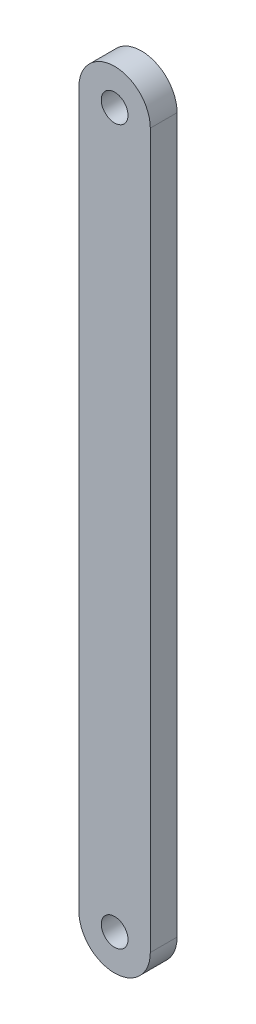
ISO-10303-21;
HEADER;
FILE_DESCRIPTION(('STEP AP214'),'2;1');
FILE_NAME('part.step','',(''),(''),'','','');
FILE_SCHEMA(('AUTOMOTIVE_DESIGN { 1 0 10303 214 1 1 1 1 }'));
ENDSEC;
DATA;
#1=APPLICATION_CONTEXT('core data for automotive mechanical design processes');
#2=APPLICATION_PROTOCOL_DEFINITION('international standard','automotive_design',2000,#1);
#3=PRODUCT_CONTEXT('',#1,'mechanical');
#4=PRODUCT('Part','Part','',(#3));
#5=PRODUCT_RELATED_PRODUCT_CATEGORY('part','',(#4));
#6=PRODUCT_DEFINITION_FORMATION('','',#4);
#7=PRODUCT_DEFINITION_CONTEXT('part definition',#1,'design');
#8=PRODUCT_DEFINITION('design','',#6,#7);
#9=PRODUCT_DEFINITION_SHAPE('','',#8);
#10=(LENGTH_UNIT() NAMED_UNIT(*) SI_UNIT(.MILLI.,.METRE.));
#11=(NAMED_UNIT(*) PLANE_ANGLE_UNIT() SI_UNIT($,.RADIAN.));
#12=(NAMED_UNIT(*) SI_UNIT($,.STERADIAN.) SOLID_ANGLE_UNIT());
#13=UNCERTAINTY_MEASURE_WITH_UNIT(LENGTH_MEASURE(1.E-05),#10,'distance_accuracy_value','');
#14=(GEOMETRIC_REPRESENTATION_CONTEXT(3) GLOBAL_UNCERTAINTY_ASSIGNED_CONTEXT((#13)) GLOBAL_UNIT_ASSIGNED_CONTEXT((#10,
#11,#12)) REPRESENTATION_CONTEXT('',''));
#15=CARTESIAN_POINT('',(0.,0.,0.));
#16=DIRECTION('',(0.,0.,1.));
#17=DIRECTION('',(1.,0.,0.));
#18=AXIS2_PLACEMENT_3D('',#15,#16,#17);
#19=CARTESIAN_POINT('',(2194.74014545616,1577.10008841039,3.));
#20=DIRECTION('',(0.,0.,1.));
#21=DIRECTION('',(1.,0.,0.));
#22=AXIS2_PLACEMENT_3D('',#19,#20,#21);
#23=PLANE('',#22);
#24=CARTESIAN_POINT('',(2194.74019545294,1577.10013840717,3.));
#25=DIRECTION('',(0.,0.,1.));
#26=DIRECTION('',(1.,0.,0.));
#27=AXIS2_PLACEMENT_3D('',#24,#25,#26);
#28=CIRCLE('',#27,1.50000000000011);
#29=CARTESIAN_POINT('',(2196.24019545294,1577.10013840717,3.));
#30=VERTEX_POINT('',#29);
#31=EDGE_CURVE('E100',#30,#30,#28,.T.);
#32=ORIENTED_EDGE('',*,*,#31,.F.);
#33=EDGE_LOOP('',(#32));
#34=FACE_BOUND('',#33,.T.);
#35=DIRECTION('',(0.,1.,0.));
#36=VECTOR('',#35,1.);
#37=CARTESIAN_POINT('',(2198.74014545616,1571.08621907019,3.));
#38=LINE('',#37,#36);
#39=CARTESIAN_POINT('',(2198.74014545517,1497.10008841174,3.));
#40=VERTEX_POINT('',#39);
#41=CARTESIAN_POINT('',(2198.74014545616,1577.10008841039,3.));
#42=VERTEX_POINT('',#41);
#43=EDGE_CURVE('E51',#40,#42,#38,.T.);
#44=ORIENTED_EDGE('',*,*,#43,.T.);
#45=CARTESIAN_POINT('',(2194.74014545616,1577.10008841039,3.));
#46=DIRECTION('',(0.,0.,1.));
#47=DIRECTION('',(1.,0.,0.));
#48=AXIS2_PLACEMENT_3D('',#45,#46,#47);
#49=CIRCLE('',#48,4.);
#50=CARTESIAN_POINT('',(2190.74014545616,1577.10008841039,3.));
#51=VERTEX_POINT('',#50);
#52=EDGE_CURVE('E81',#42,#51,#49,.T.);
#53=ORIENTED_EDGE('',*,*,#52,.T.);
#54=DIRECTION('',(2.22954618024291E-10,-1.,0.));
#55=VECTOR('',#54,1.);
#56=CARTESIAN_POINT('',(2190.74014545616,1577.10008841039,3.));
#57=LINE('',#56,#55);
#58=CARTESIAN_POINT('',(2190.74014545517,1497.10018841037,3.));
#59=VERTEX_POINT('',#58);
#60=EDGE_CURVE('E85',#51,#59,#57,.T.);
#61=ORIENTED_EDGE('',*,*,#60,.T.);
#62=CARTESIAN_POINT('',(2194.74014545455,1497.10008840878,3.));
#63=DIRECTION('',(0.,0.,1.));
#64=DIRECTION('',(1.,0.,0.));
#65=AXIS2_PLACEMENT_3D('',#62,#63,#64);
#66=CIRCLE('',#65,4.00000000062502);
#67=EDGE_CURVE('E93',#59,#40,#66,.T.);
#68=ORIENTED_EDGE('',*,*,#67,.T.);
#69=EDGE_LOOP('',(#44,#53,#61,#68));
#70=FACE_BOUND('',#69,.T.);
#71=CARTESIAN_POINT('',(2194.74014545455,1497.10008840878,3.));
#72=DIRECTION('',(0.,0.,1.));
#73=DIRECTION('',(1.,0.,0.));
#74=AXIS2_PLACEMENT_3D('',#71,#72,#73);
#75=CIRCLE('',#74,1.50000000000011);
#76=CARTESIAN_POINT('',(2196.24014545455,1497.10008840878,3.));
#77=VERTEX_POINT('',#76);
#78=EDGE_CURVE('E121',#77,#77,#75,.T.);
#79=ORIENTED_EDGE('',*,*,#78,.F.);
#80=EDGE_LOOP('',(#79));
#81=FACE_BOUND('',#80,.T.);
#82=ADVANCED_FACE('F34',(#34,#70,#81),#23,.T.);
#83=CARTESIAN_POINT('',(2194.74014545616,1577.10008841039,0.));
#84=DIRECTION('',(0.,0.,1.));
#85=DIRECTION('',(1.,0.,0.));
#86=AXIS2_PLACEMENT_3D('',#83,#84,#85);
#87=PLANE('',#86);
#88=CARTESIAN_POINT('',(2194.74014545616,1577.10008841039,0.));
#89=DIRECTION('',(0.,0.,1.));
#90=DIRECTION('',(1.,0.,0.));
#91=AXIS2_PLACEMENT_3D('',#88,#89,#90);
#92=CIRCLE('',#91,4.);
#93=CARTESIAN_POINT('',(2198.74014545616,1577.10008841039,0.));
#94=VERTEX_POINT('',#93);
#95=CARTESIAN_POINT('',(2190.74014545616,1577.10008841039,0.));
#96=VERTEX_POINT('',#95);
#97=EDGE_CURVE('E89',#94,#96,#92,.T.);
#98=ORIENTED_EDGE('',*,*,#97,.F.);
#99=DIRECTION('',(0.,1.,0.));
#100=VECTOR('',#99,1.);
#101=CARTESIAN_POINT('',(2198.74014545616,1571.08621907019,0.));
#102=LINE('',#101,#100);
#103=CARTESIAN_POINT('',(2198.74014545517,1497.10008841174,0.));
#104=VERTEX_POINT('',#103);
#105=EDGE_CURVE('E75',#104,#94,#102,.T.);
#106=ORIENTED_EDGE('',*,*,#105,.F.);
#107=CARTESIAN_POINT('',(2194.74014545455,1497.10008840878,0.));
#108=DIRECTION('',(0.,0.,1.));
#109=DIRECTION('',(1.,0.,0.));
#110=AXIS2_PLACEMENT_3D('',#107,#108,#109);
#111=CIRCLE('',#110,4.00000000062502);
#112=CARTESIAN_POINT('',(2190.74014545517,1497.10018841037,0.));
#113=VERTEX_POINT('',#112);
#114=EDGE_CURVE('E102',#113,#104,#111,.T.);
#115=ORIENTED_EDGE('',*,*,#114,.F.);
#116=DIRECTION('',(-2.10732148786526E-11,-1.,0.));
#117=VECTOR('',#116,1.);
#118=CARTESIAN_POINT('',(2190.74014545556,1515.62391237493,0.));
#119=LINE('',#118,#117);
#120=EDGE_CURVE('E68',#96,#113,#119,.T.);
#121=ORIENTED_EDGE('',*,*,#120,.F.);
#122=EDGE_LOOP('',(#98,#106,#115,#121));
#123=FACE_BOUND('',#122,.T.);
#124=CARTESIAN_POINT('',(2194.74019545294,1577.10013840717,0.));
#125=DIRECTION('',(0.,0.,1.));
#126=DIRECTION('',(1.,0.,0.));
#127=AXIS2_PLACEMENT_3D('',#124,#125,#126);
#128=CIRCLE('',#127,1.50000000000011);
#129=CARTESIAN_POINT('',(2196.24019545294,1577.10013840717,0.));
#130=VERTEX_POINT('',#129);
#131=EDGE_CURVE('E116',#130,#130,#128,.T.);
#132=ORIENTED_EDGE('',*,*,#131,.T.);
#133=EDGE_LOOP('',(#132));
#134=FACE_BOUND('',#133,.T.);
#135=CARTESIAN_POINT('',(2194.74014545455,1497.10008840878,0.));
#136=DIRECTION('',(0.,0.,1.));
#137=DIRECTION('',(1.,0.,0.));
#138=AXIS2_PLACEMENT_3D('',#135,#136,#137);
#139=CIRCLE('',#138,1.50000000000011);
#140=CARTESIAN_POINT('',(2196.24014545455,1497.10008840878,0.));
#141=VERTEX_POINT('',#140);
#142=EDGE_CURVE('E119',#141,#141,#139,.T.);
#143=ORIENTED_EDGE('',*,*,#142,.T.);
#144=EDGE_LOOP('',(#143));
#145=FACE_BOUND('',#144,.T.);
#146=ADVANCED_FACE('F109',(#123,#134,#145),#87,.F.);
#147=CARTESIAN_POINT('',(2194.74014545616,1577.10008841039,3.));
#148=DIRECTION('',(0.,0.,-1.));
#149=DIRECTION('',(-1.,0.,0.));
#150=AXIS2_PLACEMENT_3D('',#147,#148,#149);
#151=CYLINDRICAL_SURFACE('',#150,4.);
#152=ORIENTED_EDGE('',*,*,#97,.T.);
#153=DIRECTION('',(0.,0.,-1.));
#154=VECTOR('',#153,1.);
#155=CARTESIAN_POINT('',(2190.74014545616,1577.10008841039,3.));
#156=LINE('',#155,#154);
#157=EDGE_CURVE('E43',#51,#96,#156,.T.);
#158=ORIENTED_EDGE('',*,*,#157,.F.);
#159=ORIENTED_EDGE('',*,*,#52,.F.);
#160=DIRECTION('',(0.,0.,-1.));
#161=VECTOR('',#160,1.);
#162=CARTESIAN_POINT('',(2198.74014545616,1577.10008841039,3.));
#163=LINE('',#162,#161);
#164=EDGE_CURVE('E11',#42,#94,#163,.T.);
#165=ORIENTED_EDGE('',*,*,#164,.T.);
#166=EDGE_LOOP('',(#152,#158,#159,#165));
#167=FACE_BOUND('',#166,.T.);
#168=ADVANCED_FACE('F36',(#167),#151,.T.);
#169=CARTESIAN_POINT('',(2190.74014545556,1515.62391237493,3.));
#170=DIRECTION('',(1.,-2.10732148786526E-11,0.));
#171=DIRECTION('',(2.10732148786526E-11,1.,0.));
#172=AXIS2_PLACEMENT_3D('',#169,#170,#171);
#173=PLANE('',#172);
#174=ORIENTED_EDGE('',*,*,#120,.T.);
#175=DIRECTION('',(0.,0.,-1.));
#176=VECTOR('',#175,1.);
#177=CARTESIAN_POINT('',(2190.74014545517,1497.10018841037,3.));
#178=LINE('',#177,#176);
#179=EDGE_CURVE('E90',#59,#113,#178,.T.);
#180=ORIENTED_EDGE('',*,*,#179,.F.);
#181=ORIENTED_EDGE('',*,*,#60,.F.);
#182=ORIENTED_EDGE('',*,*,#157,.T.);
#183=EDGE_LOOP('',(#174,#180,#181,#182));
#184=FACE_BOUND('',#183,.T.);
#185=ADVANCED_FACE('F91',(#184),#173,.F.);
#186=CARTESIAN_POINT('',(2194.74014545455,1497.10008840878,3.));
#187=DIRECTION('',(0.,0.,-1.));
#188=DIRECTION('',(-1.,0.,0.));
#189=AXIS2_PLACEMENT_3D('',#186,#187,#188);
#190=CYLINDRICAL_SURFACE('',#189,4.00000000062502);
#191=ORIENTED_EDGE('',*,*,#114,.T.);
#192=DIRECTION('',(0.,0.,-1.));
#193=VECTOR('',#192,1.);
#194=CARTESIAN_POINT('',(2198.74014545517,1497.10008841174,3.));
#195=LINE('',#194,#193);
#196=EDGE_CURVE('E95',#40,#104,#195,.T.);
#197=ORIENTED_EDGE('',*,*,#196,.F.);
#198=ORIENTED_EDGE('',*,*,#67,.F.);
#199=ORIENTED_EDGE('',*,*,#179,.T.);
#200=EDGE_LOOP('',(#191,#197,#198,#199));
#201=FACE_BOUND('',#200,.T.);
#202=ADVANCED_FACE('F107',(#201),#190,.T.);
#203=CARTESIAN_POINT('',(2198.74014545616,1571.08621907019,3.));
#204=DIRECTION('',(-1.,0.,0.));
#205=DIRECTION('',(0.,0.,1.));
#206=AXIS2_PLACEMENT_3D('',#203,#204,#205);
#207=PLANE('',#206);
#208=ORIENTED_EDGE('',*,*,#105,.T.);
#209=ORIENTED_EDGE('',*,*,#164,.F.);
#210=ORIENTED_EDGE('',*,*,#43,.F.);
#211=ORIENTED_EDGE('',*,*,#196,.T.);
#212=EDGE_LOOP('',(#208,#209,#210,#211));
#213=FACE_BOUND('',#212,.T.);
#214=ADVANCED_FACE('F140',(#213),#207,.F.);
#215=CARTESIAN_POINT('',(2194.74019545294,1577.10013840717,3.));
#216=DIRECTION('',(0.,0.,-1.));
#217=DIRECTION('',(-1.,0.,0.));
#218=AXIS2_PLACEMENT_3D('',#215,#216,#217);
#219=CYLINDRICAL_SURFACE('',#218,1.50000000000011);
#220=ORIENTED_EDGE('',*,*,#31,.T.);
#221=EDGE_LOOP('',(#220));
#222=FACE_BOUND('',#221,.T.);
#223=ORIENTED_EDGE('',*,*,#131,.F.);
#224=EDGE_LOOP('',(#223));
#225=FACE_BOUND('',#224,.T.);
#226=ADVANCED_FACE('F130',(#222,#225),#219,.F.);
#227=CARTESIAN_POINT('',(2194.74014545455,1497.10008840878,3.));
#228=DIRECTION('',(0.,0.,-1.));
#229=DIRECTION('',(-1.,0.,0.));
#230=AXIS2_PLACEMENT_3D('',#227,#228,#229);
#231=CYLINDRICAL_SURFACE('',#230,1.50000000000011);
#232=ORIENTED_EDGE('',*,*,#78,.T.);
#233=EDGE_LOOP('',(#232));
#234=FACE_BOUND('',#233,.T.);
#235=ORIENTED_EDGE('',*,*,#142,.F.);
#236=EDGE_LOOP('',(#235));
#237=FACE_BOUND('',#236,.T.);
#238=ADVANCED_FACE('F220',(#234,#237),#231,.F.);
#239=CLOSED_SHELL('',(#82,#146,#168,#185,#202,#214,#226,#238));
#240=MANIFOLD_SOLID_BREP('B2',#239);
#241=ADVANCED_BREP_SHAPE_REPRESENTATION('',(#18,#240),#14);
#242=SHAPE_DEFINITION_REPRESENTATION(#9,#241);
ENDSEC;
END-ISO-10303-21;
